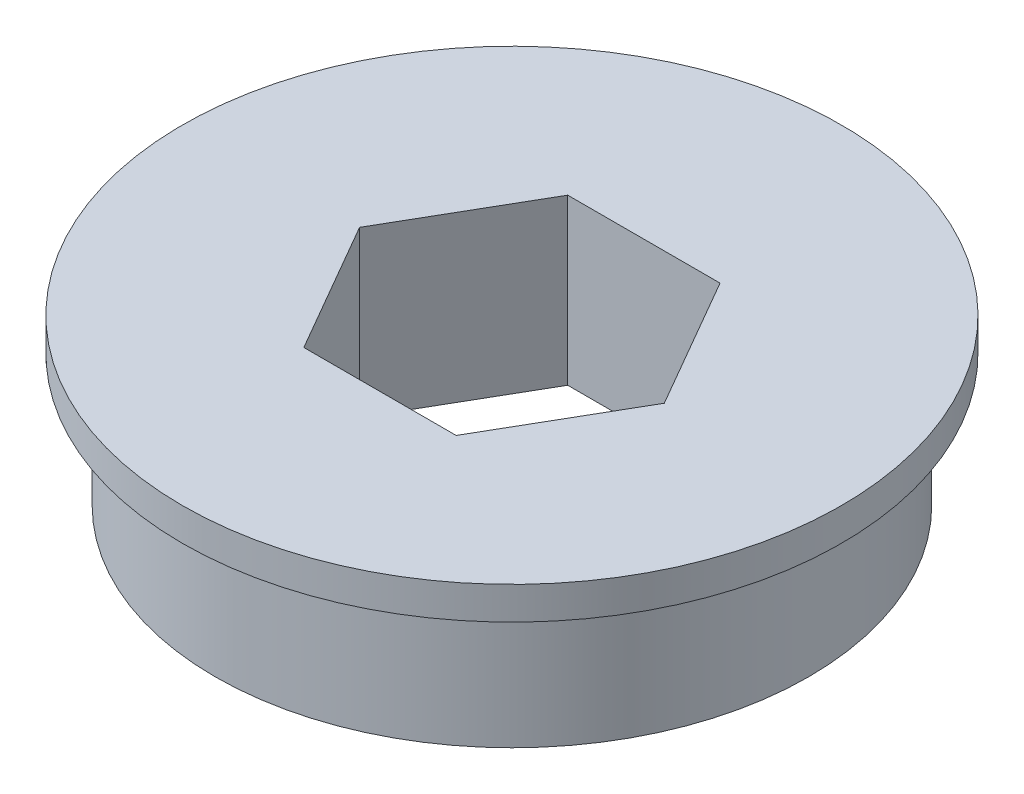
ISO-10303-21;
HEADER;
FILE_DESCRIPTION(('STEP AP214'),'2;1');
FILE_NAME('part.step','',(''),(''),'','','');
FILE_SCHEMA(('AUTOMOTIVE_DESIGN { 1 0 10303 214 1 1 1 1 }'));
ENDSEC;
DATA;
#1=APPLICATION_CONTEXT('core data for automotive mechanical design processes');
#2=APPLICATION_PROTOCOL_DEFINITION('international standard','automotive_design',2000,#1);
#3=PRODUCT_CONTEXT('',#1,'mechanical');
#4=PRODUCT('Part','Part','',(#3));
#5=PRODUCT_RELATED_PRODUCT_CATEGORY('part','',(#4));
#6=PRODUCT_DEFINITION_FORMATION('','',#4);
#7=PRODUCT_DEFINITION_CONTEXT('part definition',#1,'design');
#8=PRODUCT_DEFINITION('design','',#6,#7);
#9=PRODUCT_DEFINITION_SHAPE('','',#8);
#10=(LENGTH_UNIT() NAMED_UNIT(*) SI_UNIT(.MILLI.,.METRE.));
#11=(NAMED_UNIT(*) PLANE_ANGLE_UNIT() SI_UNIT($,.RADIAN.));
#12=(NAMED_UNIT(*) SI_UNIT($,.STERADIAN.) SOLID_ANGLE_UNIT());
#13=UNCERTAINTY_MEASURE_WITH_UNIT(LENGTH_MEASURE(1.E-05),#10,'distance_accuracy_value','');
#14=(GEOMETRIC_REPRESENTATION_CONTEXT(3) GLOBAL_UNCERTAINTY_ASSIGNED_CONTEXT((#13)) GLOBAL_UNIT_ASSIGNED_CONTEXT((#10,
#11,#12)) REPRESENTATION_CONTEXT('',''));
#15=CARTESIAN_POINT('',(0.,0.,0.));
#16=DIRECTION('',(0.,0.,1.));
#17=DIRECTION('',(1.,0.,0.));
#18=AXIS2_PLACEMENT_3D('',#15,#16,#17);
#19=CARTESIAN_POINT('',(0.,7.9248,0.));
#20=DIRECTION('',(0.,-1.,0.));
#21=DIRECTION('',(0.,0.,-1.));
#22=AXIS2_PLACEMENT_3D('',#19,#20,#21);
#23=CYLINDRICAL_SURFACE('',#22,14.2875);
#24=CARTESIAN_POINT('',(0.,0.,0.));
#25=DIRECTION('',(0.,1.,0.));
#26=DIRECTION('',(0.,0.,1.));
#27=AXIS2_PLACEMENT_3D('',#24,#25,#26);
#28=CIRCLE('',#27,14.2875);
#29=CARTESIAN_POINT('',(0.,0.,14.2875));
#30=VERTEX_POINT('',#29);
#31=EDGE_CURVE('E44',#30,#30,#28,.T.);
#32=ORIENTED_EDGE('',*,*,#31,.T.);
#33=EDGE_LOOP('',(#32));
#34=FACE_BOUND('',#33,.T.);
#35=CARTESIAN_POINT('',(0.,6.35,0.));
#36=DIRECTION('',(0.,1.,0.));
#37=DIRECTION('',(0.,0.,1.));
#38=AXIS2_PLACEMENT_3D('',#35,#36,#37);
#39=CIRCLE('',#38,14.2875);
#40=CARTESIAN_POINT('',(0.,6.35,14.2875));
#41=VERTEX_POINT('',#40);
#42=EDGE_CURVE('E11',#41,#41,#39,.T.);
#43=ORIENTED_EDGE('',*,*,#42,.F.);
#44=EDGE_LOOP('',(#43));
#45=FACE_BOUND('',#44,.T.);
#46=ADVANCED_FACE('F37',(#34,#45),#23,.T.);
#47=CARTESIAN_POINT('',(0.,7.9248,0.));
#48=DIRECTION('',(0.,1.,0.));
#49=DIRECTION('',(0.,0.,1.));
#50=AXIS2_PLACEMENT_3D('',#47,#48,#49);
#51=PLANE('',#50);
#52=DIRECTION('',(-0.500000000000001,0.,0.866025403784438));
#53=VECTOR('',#52,1.);
#54=CARTESIAN_POINT('',(-3.66617420935413,7.9248,-6.35000000000001));
#55=LINE('',#54,#53);
#56=CARTESIAN_POINT('',(-3.66617420935413,7.9248,-6.35000000000001));
#57=VERTEX_POINT('',#56);
#58=CARTESIAN_POINT('',(-7.33234841870825,7.9248,0.));
#59=VERTEX_POINT('',#58);
#60=EDGE_CURVE('E97',#57,#59,#55,.T.);
#61=ORIENTED_EDGE('',*,*,#60,.F.);
#62=DIRECTION('',(-1.,0.,0.));
#63=VECTOR('',#62,1.);
#64=CARTESIAN_POINT('',(3.66617420935415,7.9248,-6.35000000000002));
#65=LINE('',#64,#63);
#66=CARTESIAN_POINT('',(3.66617420935415,7.9248,-6.35000000000002));
#67=VERTEX_POINT('',#66);
#68=EDGE_CURVE('E89',#67,#57,#65,.T.);
#69=ORIENTED_EDGE('',*,*,#68,.F.);
#70=DIRECTION('',(-0.5,0.,-0.866025403784439));
#71=VECTOR('',#70,1.);
#72=CARTESIAN_POINT('',(7.33234841870828,7.9248,0.));
#73=LINE('',#72,#71);
#74=CARTESIAN_POINT('',(7.33234841870828,7.9248,0.));
#75=VERTEX_POINT('',#74);
#76=EDGE_CURVE('E120',#75,#67,#73,.T.);
#77=ORIENTED_EDGE('',*,*,#76,.F.);
#78=DIRECTION('',(0.499999999999999,0.,-0.866025403784439));
#79=VECTOR('',#78,1.);
#80=CARTESIAN_POINT('',(3.66617420935415,7.9248,6.35000000000002));
#81=LINE('',#80,#79);
#82=CARTESIAN_POINT('',(3.66617420935415,7.9248,6.35000000000002));
#83=VERTEX_POINT('',#82);
#84=EDGE_CURVE('E118',#83,#75,#81,.T.);
#85=ORIENTED_EDGE('',*,*,#84,.F.);
#86=DIRECTION('',(1.,0.,0.));
#87=VECTOR('',#86,1.);
#88=CARTESIAN_POINT('',(-3.6661742093541,7.9248,6.35000000000002));
#89=LINE('',#88,#87);
#90=CARTESIAN_POINT('',(-3.6661742093541,7.9248,6.35000000000002));
#91=VERTEX_POINT('',#90);
#92=EDGE_CURVE('E113',#91,#83,#89,.T.);
#93=ORIENTED_EDGE('',*,*,#92,.F.);
#94=DIRECTION('',(0.5,0.,0.866025403784438));
#95=VECTOR('',#94,1.);
#96=CARTESIAN_POINT('',(-7.33234841870825,7.9248,0.));
#97=LINE('',#96,#95);
#98=EDGE_CURVE('E111',#59,#91,#97,.T.);
#99=ORIENTED_EDGE('',*,*,#98,.F.);
#100=EDGE_LOOP('',(#61,#69,#77,#85,#93,#99));
#101=FACE_BOUND('',#100,.T.);
#102=CARTESIAN_POINT('',(0.,7.9248,0.));
#103=DIRECTION('',(0.,1.,0.));
#104=DIRECTION('',(0.,0.,1.));
#105=AXIS2_PLACEMENT_3D('',#102,#103,#104);
#106=CIRCLE('',#105,15.8623);
#107=CARTESIAN_POINT('',(0.,7.9248,15.8623));
#108=VERTEX_POINT('',#107);
#109=EDGE_CURVE('E251',#108,#108,#106,.T.);
#110=ORIENTED_EDGE('',*,*,#109,.T.);
#111=EDGE_LOOP('',(#110));
#112=FACE_BOUND('',#111,.T.);
#113=ADVANCED_FACE('F108',(#101,#112),#51,.T.);
#114=CARTESIAN_POINT('',(0.,0.,0.));
#115=DIRECTION('',(0.,1.,0.));
#116=DIRECTION('',(0.,0.,1.));
#117=AXIS2_PLACEMENT_3D('',#114,#115,#116);
#118=PLANE('',#117);
#119=ORIENTED_EDGE('',*,*,#31,.F.);
#120=EDGE_LOOP('',(#119));
#121=FACE_BOUND('',#120,.T.);
#122=DIRECTION('',(-1.,0.,0.));
#123=VECTOR('',#122,1.);
#124=CARTESIAN_POINT('',(3.66617420935415,0.,-6.35000000000002));
#125=LINE('',#124,#123);
#126=CARTESIAN_POINT('',(3.66617420935415,0.,-6.35000000000002));
#127=VERTEX_POINT('',#126);
#128=CARTESIAN_POINT('',(-3.66617420935413,0.,-6.35000000000001));
#129=VERTEX_POINT('',#128);
#130=EDGE_CURVE('E59',#127,#129,#125,.T.);
#131=ORIENTED_EDGE('',*,*,#130,.T.);
#132=DIRECTION('',(-0.500000000000001,0.,0.866025403784438));
#133=VECTOR('',#132,1.);
#134=CARTESIAN_POINT('',(-3.66617420935413,0.,-6.35000000000001));
#135=LINE('',#134,#133);
#136=CARTESIAN_POINT('',(-7.33234841870825,0.,0.));
#137=VERTEX_POINT('',#136);
#138=EDGE_CURVE('E104',#129,#137,#135,.T.);
#139=ORIENTED_EDGE('',*,*,#138,.T.);
#140=DIRECTION('',(0.5,0.,0.866025403784438));
#141=VECTOR('',#140,1.);
#142=CARTESIAN_POINT('',(-7.33234841870825,0.,0.));
#143=LINE('',#142,#141);
#144=CARTESIAN_POINT('',(-3.6661742093541,0.,6.35000000000002));
#145=VERTEX_POINT('',#144);
#146=EDGE_CURVE('E125',#137,#145,#143,.T.);
#147=ORIENTED_EDGE('',*,*,#146,.T.);
#148=DIRECTION('',(1.,0.,0.));
#149=VECTOR('',#148,1.);
#150=CARTESIAN_POINT('',(-3.6661742093541,0.,6.35000000000002));
#151=LINE('',#150,#149);
#152=CARTESIAN_POINT('',(3.66617420935415,0.,6.35000000000002));
#153=VERTEX_POINT('',#152);
#154=EDGE_CURVE('E128',#145,#153,#151,.T.);
#155=ORIENTED_EDGE('',*,*,#154,.T.);
#156=DIRECTION('',(0.499999999999999,0.,-0.866025403784439));
#157=VECTOR('',#156,1.);
#158=CARTESIAN_POINT('',(3.66617420935415,0.,6.35000000000002));
#159=LINE('',#158,#157);
#160=CARTESIAN_POINT('',(7.33234841870828,0.,0.));
#161=VERTEX_POINT('',#160);
#162=EDGE_CURVE('E131',#153,#161,#159,.T.);
#163=ORIENTED_EDGE('',*,*,#162,.T.);
#164=DIRECTION('',(-0.5,0.,-0.866025403784439));
#165=VECTOR('',#164,1.);
#166=CARTESIAN_POINT('',(7.33234841870828,0.,0.));
#167=LINE('',#166,#165);
#168=EDGE_CURVE('E98',#161,#127,#167,.T.);
#169=ORIENTED_EDGE('',*,*,#168,.T.);
#170=EDGE_LOOP('',(#131,#139,#147,#155,#163,#169));
#171=FACE_BOUND('',#170,.T.);
#172=ADVANCED_FACE('F147',(#121,#171),#118,.F.);
#173=CARTESIAN_POINT('',(3.66617420935415,7.9248,-6.35000000000002));
#174=DIRECTION('',(0.,0.,1.));
#175=DIRECTION('',(1.,0.,0.));
#176=AXIS2_PLACEMENT_3D('',#173,#174,#175);
#177=PLANE('',#176);
#178=ORIENTED_EDGE('',*,*,#130,.F.);
#179=DIRECTION('',(0.,-1.,0.));
#180=VECTOR('',#179,1.);
#181=CARTESIAN_POINT('',(3.66617420935415,7.9248,-6.35000000000002));
#182=LINE('',#181,#180);
#183=EDGE_CURVE('E93',#67,#127,#182,.T.);
#184=ORIENTED_EDGE('',*,*,#183,.F.);
#185=ORIENTED_EDGE('',*,*,#68,.T.);
#186=DIRECTION('',(0.,-1.,0.));
#187=VECTOR('',#186,1.);
#188=CARTESIAN_POINT('',(-3.66617420935413,7.9248,-6.35000000000001));
#189=LINE('',#188,#187);
#190=EDGE_CURVE('E92',#57,#129,#189,.T.);
#191=ORIENTED_EDGE('',*,*,#190,.T.);
#192=EDGE_LOOP('',(#178,#184,#185,#191));
#193=FACE_BOUND('',#192,.T.);
#194=ADVANCED_FACE('F91',(#193),#177,.T.);
#195=CARTESIAN_POINT('',(-3.66617420935413,7.9248,-6.35000000000001));
#196=DIRECTION('',(0.866025403784438,0.,0.500000000000001));
#197=DIRECTION('',(0.500000000000001,0.,-0.866025403784438));
#198=AXIS2_PLACEMENT_3D('',#195,#196,#197);
#199=PLANE('',#198);
#200=ORIENTED_EDGE('',*,*,#138,.F.);
#201=ORIENTED_EDGE('',*,*,#190,.F.);
#202=ORIENTED_EDGE('',*,*,#60,.T.);
#203=DIRECTION('',(0.,-1.,0.));
#204=VECTOR('',#203,1.);
#205=CARTESIAN_POINT('',(-7.33234841870825,7.9248,0.));
#206=LINE('',#205,#204);
#207=EDGE_CURVE('E105',#59,#137,#206,.T.);
#208=ORIENTED_EDGE('',*,*,#207,.T.);
#209=EDGE_LOOP('',(#200,#201,#202,#208));
#210=FACE_BOUND('',#209,.T.);
#211=ADVANCED_FACE('F101',(#210),#199,.T.);
#212=CARTESIAN_POINT('',(-7.33234841870825,7.9248,0.));
#213=DIRECTION('',(0.866025403784438,0.,-0.5));
#214=DIRECTION('',(-0.500000000000001,0.,-0.866025403784438));
#215=AXIS2_PLACEMENT_3D('',#212,#213,#214);
#216=PLANE('',#215);
#217=ORIENTED_EDGE('',*,*,#146,.F.);
#218=ORIENTED_EDGE('',*,*,#207,.F.);
#219=ORIENTED_EDGE('',*,*,#98,.T.);
#220=DIRECTION('',(0.,-1.,0.));
#221=VECTOR('',#220,1.);
#222=CARTESIAN_POINT('',(-3.6661742093541,7.9248,6.35000000000002));
#223=LINE('',#222,#221);
#224=EDGE_CURVE('E140',#91,#145,#223,.T.);
#225=ORIENTED_EDGE('',*,*,#224,.T.);
#226=EDGE_LOOP('',(#217,#218,#219,#225));
#227=FACE_BOUND('',#226,.T.);
#228=ADVANCED_FACE('F162',(#227),#216,.T.);
#229=CARTESIAN_POINT('',(-3.6661742093541,7.9248,6.35000000000002));
#230=DIRECTION('',(0.,0.,-1.));
#231=DIRECTION('',(-1.,0.,0.));
#232=AXIS2_PLACEMENT_3D('',#229,#230,#231);
#233=PLANE('',#232);
#234=ORIENTED_EDGE('',*,*,#154,.F.);
#235=ORIENTED_EDGE('',*,*,#224,.F.);
#236=ORIENTED_EDGE('',*,*,#92,.T.);
#237=DIRECTION('',(0.,-1.,0.));
#238=VECTOR('',#237,1.);
#239=CARTESIAN_POINT('',(3.66617420935415,7.9248,6.35000000000002));
#240=LINE('',#239,#238);
#241=EDGE_CURVE('E138',#83,#153,#240,.T.);
#242=ORIENTED_EDGE('',*,*,#241,.T.);
#243=EDGE_LOOP('',(#234,#235,#236,#242));
#244=FACE_BOUND('',#243,.T.);
#245=ADVANCED_FACE('F158',(#244),#233,.T.);
#246=CARTESIAN_POINT('',(3.66617420935415,7.9248,6.35000000000002));
#247=DIRECTION('',(-0.866025403784439,0.,-0.499999999999998));
#248=DIRECTION('',(-0.499999999999999,0.,0.86602540378444));
#249=AXIS2_PLACEMENT_3D('',#246,#247,#248);
#250=PLANE('',#249);
#251=ORIENTED_EDGE('',*,*,#162,.F.);
#252=ORIENTED_EDGE('',*,*,#241,.F.);
#253=ORIENTED_EDGE('',*,*,#84,.T.);
#254=DIRECTION('',(0.,-1.,0.));
#255=VECTOR('',#254,1.);
#256=CARTESIAN_POINT('',(7.33234841870828,7.9248,0.));
#257=LINE('',#256,#255);
#258=EDGE_CURVE('E51',#75,#161,#257,.T.);
#259=ORIENTED_EDGE('',*,*,#258,.T.);
#260=EDGE_LOOP('',(#251,#252,#253,#259));
#261=FACE_BOUND('',#260,.T.);
#262=ADVANCED_FACE('F155',(#261),#250,.T.);
#263=CARTESIAN_POINT('',(7.33234841870828,7.9248,0.));
#264=DIRECTION('',(-0.866025403784439,0.,0.5));
#265=DIRECTION('',(0.5,0.,0.866025403784439));
#266=AXIS2_PLACEMENT_3D('',#263,#264,#265);
#267=PLANE('',#266);
#268=ORIENTED_EDGE('',*,*,#168,.F.);
#269=ORIENTED_EDGE('',*,*,#258,.F.);
#270=ORIENTED_EDGE('',*,*,#76,.T.);
#271=ORIENTED_EDGE('',*,*,#183,.T.);
#272=EDGE_LOOP('',(#268,#269,#270,#271));
#273=FACE_BOUND('',#272,.T.);
#274=ADVANCED_FACE('F151',(#273),#267,.T.);
#275=CARTESIAN_POINT('',(0.,6.35,0.));
#276=DIRECTION('',(0.,1.,0.));
#277=DIRECTION('',(0.,0.,1.));
#278=AXIS2_PLACEMENT_3D('',#275,#276,#277);
#279=CYLINDRICAL_SURFACE('',#278,15.8623);
#280=CARTESIAN_POINT('',(0.,6.35,0.));
#281=DIRECTION('',(0.,1.,0.));
#282=DIRECTION('',(0.,0.,1.));
#283=AXIS2_PLACEMENT_3D('',#280,#281,#282);
#284=CIRCLE('',#283,15.8623);
#285=CARTESIAN_POINT('',(0.,6.35,15.8623));
#286=VERTEX_POINT('',#285);
#287=EDGE_CURVE('E123',#286,#286,#284,.T.);
#288=ORIENTED_EDGE('',*,*,#287,.T.);
#289=EDGE_LOOP('',(#288));
#290=FACE_BOUND('',#289,.T.);
#291=ORIENTED_EDGE('',*,*,#109,.F.);
#292=EDGE_LOOP('',(#291));
#293=FACE_BOUND('',#292,.T.);
#294=ADVANCED_FACE('F214',(#290,#293),#279,.T.);
#295=CARTESIAN_POINT('',(0.,6.35,0.));
#296=DIRECTION('',(0.,1.,0.));
#297=DIRECTION('',(0.,0.,1.));
#298=AXIS2_PLACEMENT_3D('',#295,#296,#297);
#299=PLANE('',#298);
#300=ORIENTED_EDGE('',*,*,#42,.T.);
#301=EDGE_LOOP('',(#300));
#302=FACE_BOUND('',#301,.T.);
#303=ORIENTED_EDGE('',*,*,#287,.F.);
#304=EDGE_LOOP('',(#303));
#305=FACE_BOUND('',#304,.T.);
#306=ADVANCED_FACE('F233',(#302,#305),#299,.F.);
#307=CLOSED_SHELL('',(#46,#113,#172,#194,#211,#228,#245,#262,#274,#294,#306));
#308=MANIFOLD_SOLID_BREP('B2',#307);
#309=ADVANCED_BREP_SHAPE_REPRESENTATION('',(#18,#308),#14);
#310=SHAPE_DEFINITION_REPRESENTATION(#9,#309);
ENDSEC;
END-ISO-10303-21;
